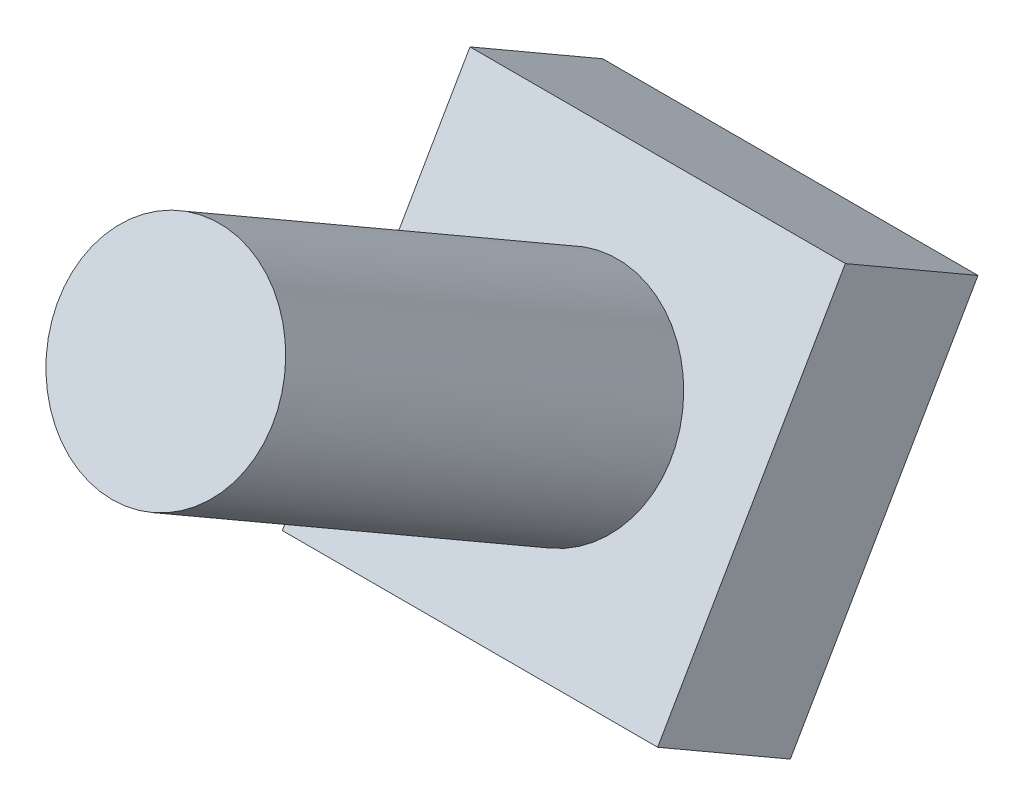
ISO-10303-21;
HEADER;
FILE_DESCRIPTION(('STEP AP214'),'2;1');
FILE_NAME('part.step','',(''),(''),'','','');
FILE_SCHEMA(('AUTOMOTIVE_DESIGN { 1 0 10303 214 1 1 1 1 }'));
ENDSEC;
DATA;
#1=APPLICATION_CONTEXT('core data for automotive mechanical design processes');
#2=APPLICATION_PROTOCOL_DEFINITION('international standard','automotive_design',2000,#1);
#3=PRODUCT_CONTEXT('',#1,'mechanical');
#4=PRODUCT('Part','Part','',(#3));
#5=PRODUCT_RELATED_PRODUCT_CATEGORY('part','',(#4));
#6=PRODUCT_DEFINITION_FORMATION('','',#4);
#7=PRODUCT_DEFINITION_CONTEXT('part definition',#1,'design');
#8=PRODUCT_DEFINITION('design','',#6,#7);
#9=PRODUCT_DEFINITION_SHAPE('','',#8);
#10=(LENGTH_UNIT() NAMED_UNIT(*) SI_UNIT(.MILLI.,.METRE.));
#11=(NAMED_UNIT(*) PLANE_ANGLE_UNIT() SI_UNIT($,.RADIAN.));
#12=(NAMED_UNIT(*) SI_UNIT($,.STERADIAN.) SOLID_ANGLE_UNIT());
#13=UNCERTAINTY_MEASURE_WITH_UNIT(LENGTH_MEASURE(1.E-05),#10,'distance_accuracy_value','');
#14=(GEOMETRIC_REPRESENTATION_CONTEXT(3) GLOBAL_UNCERTAINTY_ASSIGNED_CONTEXT((#13)) GLOBAL_UNIT_ASSIGNED_CONTEXT((#10,
#11,#12)) REPRESENTATION_CONTEXT('',''));
#15=CARTESIAN_POINT('',(0.,0.,0.));
#16=DIRECTION('',(0.,0.,1.));
#17=DIRECTION('',(1.,0.,0.));
#18=AXIS2_PLACEMENT_3D('',#15,#16,#17);
#19=CARTESIAN_POINT('',(52.9999995584542,29.8442066707183,13.3745570114252));
#20=DIRECTION('',(0.,0.499999999999999,0.866025403784439));
#21=DIRECTION('',(0.,-0.866025403784439,0.499999999999999));
#22=AXIS2_PLACEMENT_3D('',#19,#20,#21);
#23=PLANE('',#22);
#24=DIRECTION('',(1.,0.,0.));
#25=VECTOR('',#24,1.);
#26=CARTESIAN_POINT('',(98.8749995584542,38.7285300299879,8.24519052838328));
#27=LINE('',#26,#25);
#28=CARTESIAN_POINT('',(98.8749995584542,38.7285300299879,8.24519052838326));
#29=VERTEX_POINT('',#28);
#30=CARTESIAN_POINT('',(86.6249995584543,38.7285300299879,8.24519052838326));
#31=VERTEX_POINT('',#30);
#32=EDGE_CURVE('E53',#29,#31,#27,.F.);
#33=ORIENTED_EDGE('',*,*,#32,.F.);
#34=DIRECTION('',(0.,0.866025403784438,-0.5));
#35=VECTOR('',#34,1.);
#36=CARTESIAN_POINT('',(98.8749995584542,28.1197188336285,14.3701905283833));
#37=LINE('',#36,#35);
#38=CARTESIAN_POINT('',(98.8749995584542,28.1197188336285,14.3701905283833));
#39=VERTEX_POINT('',#38);
#40=EDGE_CURVE('E55',#39,#29,#37,.T.);
#41=ORIENTED_EDGE('',*,*,#40,.F.);
#42=DIRECTION('',(1.,0.,0.));
#43=VECTOR('',#42,1.);
#44=CARTESIAN_POINT('',(86.6249995584543,28.1197188336285,14.3701905283833));
#45=LINE('',#44,#43);
#46=CARTESIAN_POINT('',(86.6249995584543,28.1197188336285,14.3701905283833));
#47=VERTEX_POINT('',#46);
#48=EDGE_CURVE('E57',#47,#39,#45,.T.);
#49=ORIENTED_EDGE('',*,*,#48,.F.);
#50=DIRECTION('',(0.,-0.866025403784438,0.5));
#51=VECTOR('',#50,1.);
#52=CARTESIAN_POINT('',(86.6249995584543,38.7285300299879,8.24519052838328));
#53=LINE('',#52,#51);
#54=EDGE_CURVE('E80',#31,#47,#53,.T.);
#55=ORIENTED_EDGE('',*,*,#54,.F.);
#56=EDGE_LOOP('',(#33,#41,#49,#55));
#57=FACE_BOUND('',#56,.T.);
#58=ADVANCED_FACE('F17',(#57),#23,.F.);
#59=CARTESIAN_POINT('',(86.6249995584543,28.1197188336285,14.3701905283833));
#60=DIRECTION('',(0.,-0.866025403784439,0.5));
#61=DIRECTION('',(0.,-0.5,-0.866025403784439));
#62=AXIS2_PLACEMENT_3D('',#59,#60,#61);
#63=PLANE('',#62);
#64=DIRECTION('',(1.,0.,0.));
#65=VECTOR('',#64,1.);
#66=CARTESIAN_POINT('',(92.7499995584543,30.6197188336285,18.7003175473055));
#67=LINE('',#66,#65);
#68=CARTESIAN_POINT('',(86.6249995584543,30.6197188336285,18.7003175473055));
#69=VERTEX_POINT('',#68);
#70=CARTESIAN_POINT('',(98.8749995584542,30.6197188336285,18.7003175473055));
#71=VERTEX_POINT('',#70);
#72=EDGE_CURVE('E84',#69,#71,#67,.T.);
#73=ORIENTED_EDGE('',*,*,#72,.F.);
#74=DIRECTION('',(0.,0.499999999999999,0.866025403784439));
#75=VECTOR('',#74,1.);
#76=CARTESIAN_POINT('',(86.6249995584543,28.1197188336285,14.3701905283833));
#77=LINE('',#76,#75);
#78=EDGE_CURVE('E68',#47,#69,#77,.T.);
#79=ORIENTED_EDGE('',*,*,#78,.F.);
#80=ORIENTED_EDGE('',*,*,#48,.T.);
#81=DIRECTION('',(0.,-0.499999999999999,-0.866025403784439));
#82=VECTOR('',#81,1.);
#83=CARTESIAN_POINT('',(98.8749995584542,30.6197188336285,18.7003175473055));
#84=LINE('',#83,#82);
#85=EDGE_CURVE('E62',#71,#39,#84,.T.);
#86=ORIENTED_EDGE('',*,*,#85,.F.);
#87=EDGE_LOOP('',(#73,#79,#80,#86));
#88=FACE_BOUND('',#87,.T.);
#89=ADVANCED_FACE('F65',(#88),#63,.T.);
#90=CARTESIAN_POINT('',(98.8749995584542,28.1197188336285,14.3701905283833));
#91=DIRECTION('',(1.,0.,0.));
#92=DIRECTION('',(0.,1.,0.));
#93=AXIS2_PLACEMENT_3D('',#90,#91,#92);
#94=PLANE('',#93);
#95=DIRECTION('',(0.,-0.866025403784439,0.5));
#96=VECTOR('',#95,1.);
#97=CARTESIAN_POINT('',(98.8749995584542,35.9241244318082,15.6378175473055));
#98=LINE('',#97,#96);
#99=CARTESIAN_POINT('',(98.8749995584542,41.2285300299879,12.5753175473055));
#100=VERTEX_POINT('',#99);
#101=EDGE_CURVE('E73',#71,#100,#98,.F.);
#102=ORIENTED_EDGE('',*,*,#101,.F.);
#103=ORIENTED_EDGE('',*,*,#85,.T.);
#104=ORIENTED_EDGE('',*,*,#40,.T.);
#105=DIRECTION('',(0.,0.5,0.866025403784439));
#106=VECTOR('',#105,1.);
#107=CARTESIAN_POINT('',(98.8749995584542,38.7285300299879,8.24519052838328));
#108=LINE('',#107,#106);
#109=EDGE_CURVE('E76',#100,#29,#108,.F.);
#110=ORIENTED_EDGE('',*,*,#109,.F.);
#111=EDGE_LOOP('',(#102,#103,#104,#110));
#112=FACE_BOUND('',#111,.T.);
#113=ADVANCED_FACE('F71',(#112),#94,.T.);
#114=CARTESIAN_POINT('',(98.8749995584542,38.7285300299879,8.24519052838328));
#115=DIRECTION('',(0.,0.866025403784439,-0.5));
#116=DIRECTION('',(0.,0.5,0.866025403784439));
#117=AXIS2_PLACEMENT_3D('',#114,#115,#116);
#118=PLANE('',#117);
#119=DIRECTION('',(1.,0.,0.));
#120=VECTOR('',#119,1.);
#121=CARTESIAN_POINT('',(92.7499995584543,41.2285300299879,12.5753175473055));
#122=LINE('',#121,#120);
#123=CARTESIAN_POINT('',(86.6249995584543,41.2285300299879,12.5753175473055));
#124=VERTEX_POINT('',#123);
#125=EDGE_CURVE('E87',#100,#124,#122,.F.);
#126=ORIENTED_EDGE('',*,*,#125,.F.);
#127=ORIENTED_EDGE('',*,*,#109,.T.);
#128=ORIENTED_EDGE('',*,*,#32,.T.);
#129=DIRECTION('',(0.,-0.499999999999997,-0.86602540378444));
#130=VECTOR('',#129,1.);
#131=CARTESIAN_POINT('',(86.6249995584543,41.2285300299879,12.5753175473055));
#132=LINE('',#131,#130);
#133=EDGE_CURVE('E33',#124,#31,#132,.T.);
#134=ORIENTED_EDGE('',*,*,#133,.F.);
#135=EDGE_LOOP('',(#126,#127,#128,#134));
#136=FACE_BOUND('',#135,.T.);
#137=ADVANCED_FACE('F110',(#136),#118,.T.);
#138=CARTESIAN_POINT('',(86.6249995584543,38.7285300299879,8.24519052838328));
#139=DIRECTION('',(-1.,0.,0.));
#140=DIRECTION('',(0.,-1.,0.));
#141=AXIS2_PLACEMENT_3D('',#138,#139,#140);
#142=PLANE('',#141);
#143=DIRECTION('',(0.,-0.866025403784439,0.5));
#144=VECTOR('',#143,1.);
#145=CARTESIAN_POINT('',(86.6249995584543,35.9241244318082,15.6378175473055));
#146=LINE('',#145,#144);
#147=EDGE_CURVE('E90',#124,#69,#146,.T.);
#148=ORIENTED_EDGE('',*,*,#147,.F.);
#149=ORIENTED_EDGE('',*,*,#133,.T.);
#150=ORIENTED_EDGE('',*,*,#54,.T.);
#151=ORIENTED_EDGE('',*,*,#78,.T.);
#152=EDGE_LOOP('',(#148,#149,#150,#151));
#153=FACE_BOUND('',#152,.T.);
#154=ADVANCED_FACE('F101',(#153),#142,.T.);
#155=CARTESIAN_POINT('',(92.7499995584542,43.4241244318082,28.6281986040721));
#156=DIRECTION('',(0.,0.5,0.866025403784439));
#157=DIRECTION('',(0.,-0.866025403784439,0.5));
#158=AXIS2_PLACEMENT_3D('',#155,#156,#157);
#159=PLANE('',#158);
#160=CARTESIAN_POINT('',(92.7499995584542,43.4241244318082,28.6281986040721));
#161=DIRECTION('',(0.,0.5,0.866025403784439));
#162=DIRECTION('',(0.,-0.866025403784439,0.5));
#163=AXIS2_PLACEMENT_3D('',#160,#161,#162);
#164=CIRCLE('',#163,3.5);
#165=CARTESIAN_POINT('',(92.7499995584542,40.3930355185627,30.3781986040721));
#166=VERTEX_POINT('',#165);
#167=EDGE_CURVE('E20',#166,#166,#164,.F.);
#168=ORIENTED_EDGE('',*,*,#167,.F.);
#169=EDGE_LOOP('',(#168));
#170=FACE_BOUND('',#169,.T.);
#171=ADVANCED_FACE('F98',(#170),#159,.T.);
#172=CARTESIAN_POINT('',(92.7499995584543,35.9241244318082,15.6378175473055));
#173=DIRECTION('',(0.,0.5,0.866025403784439));
#174=DIRECTION('',(0.,-0.866025403784439,0.5));
#175=AXIS2_PLACEMENT_3D('',#172,#173,#174);
#176=PLANE('',#175);
#177=CARTESIAN_POINT('',(92.7499995584542,35.9241244318082,15.6378175473055));
#178=DIRECTION('',(0.,0.5,0.866025403784439));
#179=DIRECTION('',(0.,-0.866025403784439,0.5));
#180=AXIS2_PLACEMENT_3D('',#177,#178,#179);
#181=CIRCLE('',#180,3.5);
#182=CARTESIAN_POINT('',(92.7499995584542,32.8930355185627,17.3878175473055));
#183=VERTEX_POINT('',#182);
#184=EDGE_CURVE('E11',#183,#183,#181,.T.);
#185=ORIENTED_EDGE('',*,*,#184,.F.);
#186=EDGE_LOOP('',(#185));
#187=FACE_BOUND('',#186,.T.);
#188=ORIENTED_EDGE('',*,*,#125,.T.);
#189=ORIENTED_EDGE('',*,*,#147,.T.);
#190=ORIENTED_EDGE('',*,*,#72,.T.);
#191=ORIENTED_EDGE('',*,*,#101,.T.);
#192=EDGE_LOOP('',(#188,#189,#190,#191));
#193=FACE_BOUND('',#192,.T.);
#194=ADVANCED_FACE('F100',(#187,#193),#176,.T.);
#195=CARTESIAN_POINT('',(92.7499995584542,33.4241244318082,11.3076905283833));
#196=DIRECTION('',(0.,0.5,0.866025403784439));
#197=DIRECTION('',(0.,-0.866025403784439,0.5));
#198=AXIS2_PLACEMENT_3D('',#195,#196,#197);
#199=CYLINDRICAL_SURFACE('',#198,3.5);
#200=ORIENTED_EDGE('',*,*,#184,.T.);
#201=EDGE_LOOP('',(#200));
#202=FACE_BOUND('',#201,.T.);
#203=ORIENTED_EDGE('',*,*,#167,.T.);
#204=EDGE_LOOP('',(#203));
#205=FACE_BOUND('',#204,.T.);
#206=ADVANCED_FACE('F96',(#202,#205),#199,.T.);
#207=CLOSED_SHELL('',(#58,#89,#113,#137,#154,#171,#194,#206));
#208=MANIFOLD_SOLID_BREP('B1',#207);
#209=ADVANCED_BREP_SHAPE_REPRESENTATION('',(#18,#208),#14);
#210=SHAPE_DEFINITION_REPRESENTATION(#9,#209);
ENDSEC;
END-ISO-10303-21;
